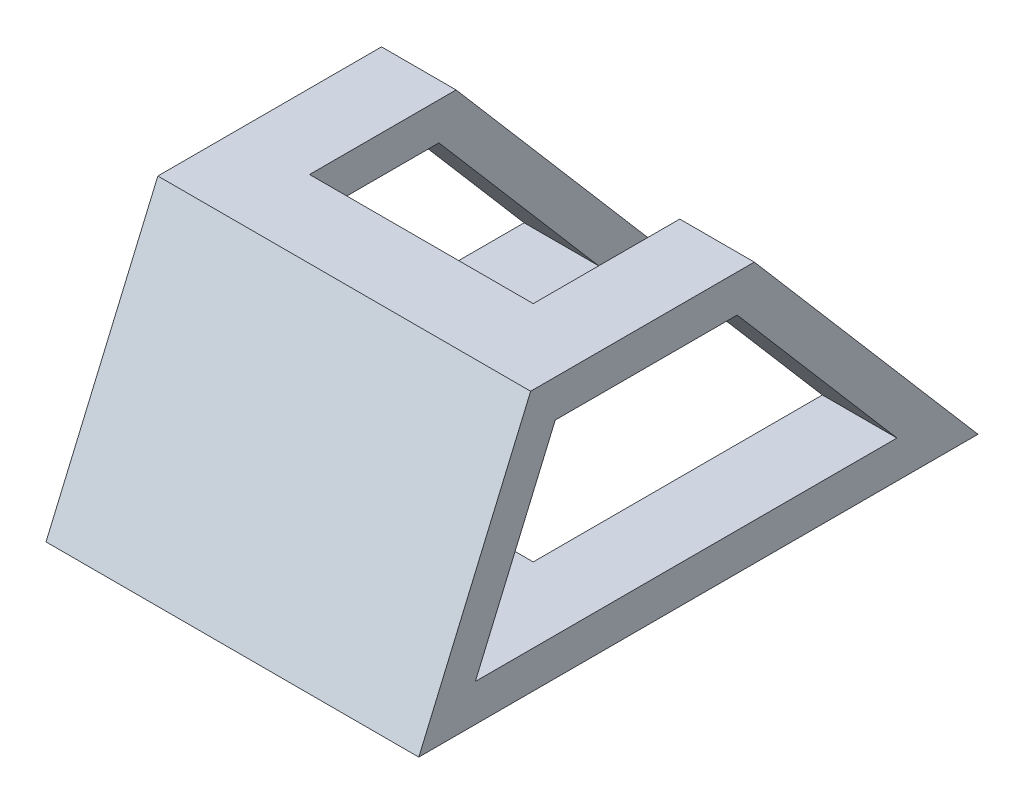
ISO-10303-21;
HEADER;
FILE_DESCRIPTION(('STEP AP214'),'2;1');
FILE_NAME('part.step','',(''),(''),'','','');
FILE_SCHEMA(('AUTOMOTIVE_DESIGN { 1 0 10303 214 1 1 1 1 }'));
ENDSEC;
DATA;
#1=APPLICATION_CONTEXT('core data for automotive mechanical design processes');
#2=APPLICATION_PROTOCOL_DEFINITION('international standard','automotive_design',2000,#1);
#3=PRODUCT_CONTEXT('',#1,'mechanical');
#4=PRODUCT('Part','Part','',(#3));
#5=PRODUCT_RELATED_PRODUCT_CATEGORY('part','',(#4));
#6=PRODUCT_DEFINITION_FORMATION('','',#4);
#7=PRODUCT_DEFINITION_CONTEXT('part definition',#1,'design');
#8=PRODUCT_DEFINITION('design','',#6,#7);
#9=PRODUCT_DEFINITION_SHAPE('','',#8);
#10=(LENGTH_UNIT() NAMED_UNIT(*) SI_UNIT(.MILLI.,.METRE.));
#11=(NAMED_UNIT(*) PLANE_ANGLE_UNIT() SI_UNIT($,.RADIAN.));
#12=(NAMED_UNIT(*) SI_UNIT($,.STERADIAN.) SOLID_ANGLE_UNIT());
#13=UNCERTAINTY_MEASURE_WITH_UNIT(LENGTH_MEASURE(1.E-05),#10,'distance_accuracy_value','');
#14=(GEOMETRIC_REPRESENTATION_CONTEXT(3) GLOBAL_UNCERTAINTY_ASSIGNED_CONTEXT((#13)) GLOBAL_UNIT_ASSIGNED_CONTEXT((#10,
#11,#12)) REPRESENTATION_CONTEXT('',''));
#15=CARTESIAN_POINT('',(0.,0.,0.));
#16=DIRECTION('',(0.,0.,1.));
#17=DIRECTION('',(1.,0.,0.));
#18=AXIS2_PLACEMENT_3D('',#15,#16,#17);
#19=CARTESIAN_POINT('',(100.,70.,-15.));
#20=DIRECTION('',(0.,-0.650791373455969,0.759256602365296));
#21=DIRECTION('',(0.,-0.759256602365296,-0.650791373455969));
#22=AXIS2_PLACEMENT_3D('',#19,#20,#21);
#23=PLANE('',#22);
#24=DIRECTION('',(0.,-0.759256602365296,-0.650791373455969));
#25=VECTOR('',#24,1.);
#26=CARTESIAN_POINT('',(80.,70.,-15.));
#27=LINE('',#26,#25);
#28=CARTESIAN_POINT('',(80.,70.,-15.));
#29=VERTEX_POINT('',#28);
#30=CARTESIAN_POINT('',(80.,0.,-75.));
#31=VERTEX_POINT('',#30);
#32=EDGE_CURVE('E67',#29,#31,#27,.T.);
#33=ORIENTED_EDGE('',*,*,#32,.F.);
#34=DIRECTION('',(-1.,0.,0.));
#35=VECTOR('',#34,1.);
#36=CARTESIAN_POINT('',(100.,70.,-15.));
#37=LINE('',#36,#35);
#38=CARTESIAN_POINT('',(100.,70.,-15.));
#39=VERTEX_POINT('',#38);
#40=EDGE_CURVE('E313',#39,#29,#37,.T.);
#41=ORIENTED_EDGE('',*,*,#40,.F.);
#42=DIRECTION('',(0.,0.759256602365296,0.650791373455969));
#43=VECTOR('',#42,1.);
#44=CARTESIAN_POINT('',(100.,70.,-15.));
#45=LINE('',#44,#43);
#46=CARTESIAN_POINT('',(100.,0.,-75.));
#47=VERTEX_POINT('',#46);
#48=EDGE_CURVE('E274',#47,#39,#45,.T.);
#49=ORIENTED_EDGE('',*,*,#48,.F.);
#50=DIRECTION('',(-1.,0.,0.));
#51=VECTOR('',#50,1.);
#52=CARTESIAN_POINT('',(100.,0.,-75.));
#53=LINE('',#52,#51);
#54=EDGE_CURVE('E301',#47,#31,#53,.T.);
#55=ORIENTED_EDGE('',*,*,#54,.T.);
#56=EDGE_LOOP('',(#33,#41,#49,#55));
#57=FACE_BOUND('',#56,.T.);
#58=ADVANCED_FACE('F51',(#57),#23,.F.);
#59=CARTESIAN_POINT('',(100.,60.,-10.4006507752959));
#60=DIRECTION('',(0.,-0.650791373455969,0.759256602365296));
#61=DIRECTION('',(0.,-0.759256602365296,-0.650791373455969));
#62=AXIS2_PLACEMENT_3D('',#59,#60,#61);
#63=PLANE('',#62);
#64=DIRECTION('',(-1.,0.,0.));
#65=VECTOR('',#64,1.);
#66=CARTESIAN_POINT('',(100.,60.,-10.4006507752959));
#67=LINE('',#66,#65);
#68=CARTESIAN_POINT('',(100.,60.,-10.4006507752959));
#69=VERTEX_POINT('',#68);
#70=CARTESIAN_POINT('',(80.,60.,-10.4006507752959));
#71=VERTEX_POINT('',#70);
#72=EDGE_CURVE('E260',#69,#71,#67,.T.);
#73=ORIENTED_EDGE('',*,*,#72,.T.);
#74=DIRECTION('',(0.,-0.759256602365296,-0.650791373455969));
#75=VECTOR('',#74,1.);
#76=CARTESIAN_POINT('',(80.,60.,-10.4006507752959));
#77=LINE('',#76,#75);
#78=CARTESIAN_POINT('',(80.,10.,-53.2577936324388));
#79=VERTEX_POINT('',#78);
#80=EDGE_CURVE('E74',#71,#79,#77,.T.);
#81=ORIENTED_EDGE('',*,*,#80,.T.);
#82=DIRECTION('',(-1.,0.,0.));
#83=VECTOR('',#82,1.);
#84=CARTESIAN_POINT('',(100.,10.,-53.2577936324388));
#85=LINE('',#84,#83);
#86=CARTESIAN_POINT('',(100.,10.,-53.2577936324388));
#87=VERTEX_POINT('',#86);
#88=EDGE_CURVE('E265',#87,#79,#85,.T.);
#89=ORIENTED_EDGE('',*,*,#88,.F.);
#90=DIRECTION('',(0.,0.759256602365296,0.650791373455969));
#91=VECTOR('',#90,1.);
#92=CARTESIAN_POINT('',(100.,60.,-10.4006507752959));
#93=LINE('',#92,#91);
#94=EDGE_CURVE('E234',#87,#69,#93,.T.);
#95=ORIENTED_EDGE('',*,*,#94,.T.);
#96=EDGE_LOOP('',(#73,#81,#89,#95));
#97=FACE_BOUND('',#96,.T.);
#98=ADVANCED_FACE('F379',(#97),#63,.T.);
#99=CARTESIAN_POINT('',(100.,0.,0.));
#100=DIRECTION('',(1.,0.,0.));
#101=DIRECTION('',(0.,0.,-1.));
#102=AXIS2_PLACEMENT_3D('',#99,#100,#101);
#103=PLANE('',#102);
#104=ORIENTED_EDGE('',*,*,#48,.T.);
#105=DIRECTION('',(0.,0.,1.));
#106=VECTOR('',#105,1.);
#107=CARTESIAN_POINT('',(100.,70.,45.));
#108=LINE('',#107,#106);
#109=CARTESIAN_POINT('',(100.,70.,45.));
#110=VERTEX_POINT('',#109);
#111=EDGE_CURVE('E278',#39,#110,#108,.T.);
#112=ORIENTED_EDGE('',*,*,#111,.T.);
#113=DIRECTION('',(0.,-0.919145030018058,0.393919298579168));
#114=VECTOR('',#113,1.);
#115=CARTESIAN_POINT('',(100.,0.,75.));
#116=LINE('',#115,#114);
#117=CARTESIAN_POINT('',(100.,0.,75.));
#118=VERTEX_POINT('',#117);
#119=EDGE_CURVE('E282',#110,#118,#116,.T.);
#120=ORIENTED_EDGE('',*,*,#119,.T.);
#121=DIRECTION('',(0.,0.,-1.));
#122=VECTOR('',#121,1.);
#123=CARTESIAN_POINT('',(100.,0.,75.));
#124=LINE('',#123,#122);
#125=EDGE_CURVE('E285',#118,#47,#124,.T.);
#126=ORIENTED_EDGE('',*,*,#125,.T.);
#127=EDGE_LOOP('',(#104,#112,#120,#126));
#128=FACE_BOUND('',#127,.T.);
#129=DIRECTION('',(0.,0.,-1.));
#130=VECTOR('',#129,1.);
#131=CARTESIAN_POINT('',(100.,10.,59.8346098487658));
#132=LINE('',#131,#130);
#133=CARTESIAN_POINT('',(100.,10.,59.8346098487658));
#134=VERTEX_POINT('',#133);
#135=EDGE_CURVE('E230',#134,#87,#132,.T.);
#136=ORIENTED_EDGE('',*,*,#135,.F.);
#137=DIRECTION('',(0.,-0.919145030018058,0.393919298579168));
#138=VECTOR('',#137,1.);
#139=CARTESIAN_POINT('',(100.,10.,59.8346098487658));
#140=LINE('',#139,#138);
#141=CARTESIAN_POINT('',(100.,60.,38.4060384201944));
#142=VERTEX_POINT('',#141);
#143=EDGE_CURVE('E227',#142,#134,#140,.T.);
#144=ORIENTED_EDGE('',*,*,#143,.F.);
#145=DIRECTION('',(0.,0.,1.));
#146=VECTOR('',#145,1.);
#147=CARTESIAN_POINT('',(100.,60.,38.4060384201944));
#148=LINE('',#147,#146);
#149=EDGE_CURVE('E238',#69,#142,#148,.T.);
#150=ORIENTED_EDGE('',*,*,#149,.F.);
#151=ORIENTED_EDGE('',*,*,#94,.F.);
#152=EDGE_LOOP('',(#136,#144,#150,#151));
#153=FACE_BOUND('',#152,.T.);
#154=ADVANCED_FACE('F351',(#128,#153),#103,.T.);
#155=CARTESIAN_POINT('',(0.,0.,0.));
#156=DIRECTION('',(1.,0.,0.));
#157=DIRECTION('',(0.,0.,-1.));
#158=AXIS2_PLACEMENT_3D('',#155,#156,#157);
#159=PLANE('',#158);
#160=DIRECTION('',(0.,0.759256602365296,0.650791373455969));
#161=VECTOR('',#160,1.);
#162=CARTESIAN_POINT('',(0.,70.,-15.));
#163=LINE('',#162,#161);
#164=CARTESIAN_POINT('',(0.,0.,-75.));
#165=VERTEX_POINT('',#164);
#166=CARTESIAN_POINT('',(0.,70.,-15.));
#167=VERTEX_POINT('',#166);
#168=EDGE_CURVE('E273',#165,#167,#163,.T.);
#169=ORIENTED_EDGE('',*,*,#168,.F.);
#170=DIRECTION('',(0.,0.,-1.));
#171=VECTOR('',#170,1.);
#172=CARTESIAN_POINT('',(0.,0.,75.));
#173=LINE('',#172,#171);
#174=CARTESIAN_POINT('',(0.,0.,75.));
#175=VERTEX_POINT('',#174);
#176=EDGE_CURVE('E279',#175,#165,#173,.T.);
#177=ORIENTED_EDGE('',*,*,#176,.F.);
#178=DIRECTION('',(0.,-0.919145030018058,0.393919298579168));
#179=VECTOR('',#178,1.);
#180=CARTESIAN_POINT('',(0.,0.,75.));
#181=LINE('',#180,#179);
#182=CARTESIAN_POINT('',(0.,70.,45.));
#183=VERTEX_POINT('',#182);
#184=EDGE_CURVE('E295',#183,#175,#181,.T.);
#185=ORIENTED_EDGE('',*,*,#184,.F.);
#186=DIRECTION('',(0.,0.,1.));
#187=VECTOR('',#186,1.);
#188=CARTESIAN_POINT('',(0.,70.,45.));
#189=LINE('',#188,#187);
#190=EDGE_CURVE('E292',#167,#183,#189,.T.);
#191=ORIENTED_EDGE('',*,*,#190,.F.);
#192=EDGE_LOOP('',(#169,#177,#185,#191));
#193=FACE_BOUND('',#192,.T.);
#194=DIRECTION('',(0.,-0.919145030018058,0.393919298579168));
#195=VECTOR('',#194,1.);
#196=CARTESIAN_POINT('',(0.,10.,59.8346098487658));
#197=LINE('',#196,#195);
#198=CARTESIAN_POINT('',(0.,60.,38.4060384201944));
#199=VERTEX_POINT('',#198);
#200=CARTESIAN_POINT('',(0.,10.,59.8346098487658));
#201=VERTEX_POINT('',#200);
#202=EDGE_CURVE('E226',#199,#201,#197,.T.);
#203=ORIENTED_EDGE('',*,*,#202,.T.);
#204=DIRECTION('',(0.,0.,-1.));
#205=VECTOR('',#204,1.);
#206=CARTESIAN_POINT('',(0.,10.,59.8346098487658));
#207=LINE('',#206,#205);
#208=CARTESIAN_POINT('',(0.,10.,-53.2577936324388));
#209=VERTEX_POINT('',#208);
#210=EDGE_CURVE('E245',#201,#209,#207,.T.);
#211=ORIENTED_EDGE('',*,*,#210,.T.);
#212=DIRECTION('',(0.,0.759256602365296,0.650791373455969));
#213=VECTOR('',#212,1.);
#214=CARTESIAN_POINT('',(0.,60.,-10.4006507752959));
#215=LINE('',#214,#213);
#216=CARTESIAN_POINT('',(0.,60.,-10.4006507752959));
#217=VERTEX_POINT('',#216);
#218=EDGE_CURVE('E249',#209,#217,#215,.T.);
#219=ORIENTED_EDGE('',*,*,#218,.T.);
#220=DIRECTION('',(0.,0.,1.));
#221=VECTOR('',#220,1.);
#222=CARTESIAN_POINT('',(0.,60.,38.4060384201944));
#223=LINE('',#222,#221);
#224=EDGE_CURVE('E231',#217,#199,#223,.T.);
#225=ORIENTED_EDGE('',*,*,#224,.T.);
#226=EDGE_LOOP('',(#203,#211,#219,#225));
#227=FACE_BOUND('',#226,.T.);
#228=ADVANCED_FACE('F360',(#193,#227),#159,.F.);
#229=CARTESIAN_POINT('',(20.,70.,-15.));
#230=VERTEX_POINT('',#229);
#231=EDGE_CURVE('E312',#230,#167,#37,.T.);
#232=ORIENTED_EDGE('',*,*,#231,.F.);
#233=DIRECTION('',(0.,-0.759256602365296,-0.650791373455969));
#234=VECTOR('',#233,1.);
#235=CARTESIAN_POINT('',(20.,70.,-15.));
#236=LINE('',#235,#234);
#237=CARTESIAN_POINT('',(20.,0.,-75.));
#238=VERTEX_POINT('',#237);
#239=EDGE_CURVE('E220',#230,#238,#236,.T.);
#240=ORIENTED_EDGE('',*,*,#239,.T.);
#241=EDGE_CURVE('E288',#238,#165,#53,.T.);
#242=ORIENTED_EDGE('',*,*,#241,.T.);
#243=ORIENTED_EDGE('',*,*,#168,.T.);
#244=EDGE_LOOP('',(#232,#240,#242,#243));
#245=FACE_BOUND('',#244,.T.);
#246=ADVANCED_FACE('F53',(#245),#23,.F.);
#247=CARTESIAN_POINT('',(100.,70.,45.));
#248=DIRECTION('',(0.,-1.,0.));
#249=DIRECTION('',(0.,0.,-1.));
#250=AXIS2_PLACEMENT_3D('',#247,#248,#249);
#251=PLANE('',#250);
#252=DIRECTION('',(1.,0.,0.));
#253=VECTOR('',#252,1.);
#254=CARTESIAN_POINT('',(20.,70.,24.3027668576911));
#255=LINE('',#254,#253);
#256=CARTESIAN_POINT('',(20.,70.,24.3027668576911));
#257=VERTEX_POINT('',#256);
#258=CARTESIAN_POINT('',(80.,70.,24.3027668576911));
#259=VERTEX_POINT('',#258);
#260=EDGE_CURVE('E197',#257,#259,#255,.T.);
#261=ORIENTED_EDGE('',*,*,#260,.F.);
#262=DIRECTION('',(0.,0.,1.));
#263=VECTOR('',#262,1.);
#264=CARTESIAN_POINT('',(20.,70.,-75.6972331423089));
#265=LINE('',#264,#263);
#266=EDGE_CURVE('E188',#230,#257,#265,.T.);
#267=ORIENTED_EDGE('',*,*,#266,.F.);
#268=ORIENTED_EDGE('',*,*,#231,.T.);
#269=ORIENTED_EDGE('',*,*,#190,.T.);
#270=DIRECTION('',(-1.,0.,0.));
#271=VECTOR('',#270,1.);
#272=CARTESIAN_POINT('',(100.,70.,45.));
#273=LINE('',#272,#271);
#274=EDGE_CURVE('E308',#110,#183,#273,.T.);
#275=ORIENTED_EDGE('',*,*,#274,.F.);
#276=ORIENTED_EDGE('',*,*,#111,.F.);
#277=ORIENTED_EDGE('',*,*,#40,.T.);
#278=DIRECTION('',(0.,0.,1.));
#279=VECTOR('',#278,1.);
#280=CARTESIAN_POINT('',(80.,70.,-75.6972331423089));
#281=LINE('',#280,#279);
#282=EDGE_CURVE('E192',#29,#259,#281,.T.);
#283=ORIENTED_EDGE('',*,*,#282,.T.);
#284=EDGE_LOOP('',(#261,#267,#268,#269,#275,#276,#277,#283));
#285=FACE_BOUND('',#284,.T.);
#286=ADVANCED_FACE('F342',(#285),#251,.F.);
#287=CARTESIAN_POINT('',(100.,0.,75.));
#288=DIRECTION('',(0.,-0.393919298579168,-0.919145030018058));
#289=DIRECTION('',(0.,0.919145030018058,-0.393919298579168));
#290=AXIS2_PLACEMENT_3D('',#287,#288,#289);
#291=PLANE('',#290);
#292=ORIENTED_EDGE('',*,*,#184,.T.);
#293=DIRECTION('',(-1.,0.,0.));
#294=VECTOR('',#293,1.);
#295=CARTESIAN_POINT('',(100.,0.,75.));
#296=LINE('',#295,#294);
#297=EDGE_CURVE('E304',#118,#175,#296,.T.);
#298=ORIENTED_EDGE('',*,*,#297,.F.);
#299=ORIENTED_EDGE('',*,*,#119,.F.);
#300=ORIENTED_EDGE('',*,*,#274,.T.);
#301=EDGE_LOOP('',(#292,#298,#299,#300));
#302=FACE_BOUND('',#301,.T.);
#303=ADVANCED_FACE('F355',(#302),#291,.F.);
#304=CARTESIAN_POINT('',(100.,0.,75.));
#305=DIRECTION('',(0.,1.,0.));
#306=DIRECTION('',(0.,0.,1.));
#307=AXIS2_PLACEMENT_3D('',#304,#305,#306);
#308=PLANE('',#307);
#309=ORIENTED_EDGE('',*,*,#241,.F.);
#310=DIRECTION('',(0.,0.,1.));
#311=VECTOR('',#310,1.);
#312=CARTESIAN_POINT('',(20.,0.,-75.6972331423089));
#313=LINE('',#312,#311);
#314=CARTESIAN_POINT('',(20.,0.,24.3027668576911));
#315=VERTEX_POINT('',#314);
#316=EDGE_CURVE('E171',#238,#315,#313,.T.);
#317=ORIENTED_EDGE('',*,*,#316,.T.);
#318=DIRECTION('',(1.,0.,0.));
#319=VECTOR('',#318,1.);
#320=CARTESIAN_POINT('',(20.,0.,24.3027668576911));
#321=LINE('',#320,#319);
#322=CARTESIAN_POINT('',(80.,0.,24.3027668576911));
#323=VERTEX_POINT('',#322);
#324=EDGE_CURVE('E172',#315,#323,#321,.T.);
#325=ORIENTED_EDGE('',*,*,#324,.T.);
#326=DIRECTION('',(0.,0.,1.));
#327=VECTOR('',#326,1.);
#328=CARTESIAN_POINT('',(80.,0.,-75.6972331423089));
#329=LINE('',#328,#327);
#330=EDGE_CURVE('E161',#31,#323,#329,.T.);
#331=ORIENTED_EDGE('',*,*,#330,.F.);
#332=ORIENTED_EDGE('',*,*,#54,.F.);
#333=ORIENTED_EDGE('',*,*,#125,.F.);
#334=ORIENTED_EDGE('',*,*,#297,.T.);
#335=ORIENTED_EDGE('',*,*,#176,.T.);
#336=EDGE_LOOP('',(#309,#317,#325,#331,#332,#333,#334,#335));
#337=FACE_BOUND('',#336,.T.);
#338=ADVANCED_FACE('F186',(#337),#308,.F.);
#339=CARTESIAN_POINT('',(100.,10.,59.8346098487658));
#340=DIRECTION('',(0.,-0.393919298579168,-0.919145030018058));
#341=DIRECTION('',(0.,0.919145030018058,-0.393919298579168));
#342=AXIS2_PLACEMENT_3D('',#339,#340,#341);
#343=PLANE('',#342);
#344=ORIENTED_EDGE('',*,*,#202,.F.);
#345=DIRECTION('',(-1.,0.,0.));
#346=VECTOR('',#345,1.);
#347=CARTESIAN_POINT('',(100.,60.,38.4060384201944));
#348=LINE('',#347,#346);
#349=EDGE_CURVE('E241',#142,#199,#348,.T.);
#350=ORIENTED_EDGE('',*,*,#349,.F.);
#351=ORIENTED_EDGE('',*,*,#143,.T.);
#352=DIRECTION('',(-1.,0.,0.));
#353=VECTOR('',#352,1.);
#354=CARTESIAN_POINT('',(100.,10.,59.8346098487658));
#355=LINE('',#354,#353);
#356=EDGE_CURVE('E269',#134,#201,#355,.T.);
#357=ORIENTED_EDGE('',*,*,#356,.T.);
#358=EDGE_LOOP('',(#344,#350,#351,#357));
#359=FACE_BOUND('',#358,.T.);
#360=ADVANCED_FACE('F372',(#359),#343,.T.);
#361=CARTESIAN_POINT('',(100.,10.,59.8346098487658));
#362=DIRECTION('',(0.,1.,0.));
#363=DIRECTION('',(0.,0.,1.));
#364=AXIS2_PLACEMENT_3D('',#361,#362,#363);
#365=PLANE('',#364);
#366=DIRECTION('',(0.,0.,1.));
#367=VECTOR('',#366,1.);
#368=CARTESIAN_POINT('',(20.,10.,59.8346098487659));
#369=LINE('',#368,#367);
#370=CARTESIAN_POINT('',(20.,9.99999999999999,-53.2577936324388));
#371=VERTEX_POINT('',#370);
#372=CARTESIAN_POINT('',(20.,10.,24.3027668576911));
#373=VERTEX_POINT('',#372);
#374=EDGE_CURVE('E217',#371,#373,#369,.T.);
#375=ORIENTED_EDGE('',*,*,#374,.F.);
#376=EDGE_CURVE('E264',#371,#209,#85,.T.);
#377=ORIENTED_EDGE('',*,*,#376,.T.);
#378=ORIENTED_EDGE('',*,*,#210,.F.);
#379=ORIENTED_EDGE('',*,*,#356,.F.);
#380=ORIENTED_EDGE('',*,*,#135,.T.);
#381=ORIENTED_EDGE('',*,*,#88,.T.);
#382=DIRECTION('',(0.,0.,1.));
#383=VECTOR('',#382,1.);
#384=CARTESIAN_POINT('',(80.,10.,59.8346098487659));
#385=LINE('',#384,#383);
#386=CARTESIAN_POINT('',(80.,10.,24.3027668576911));
#387=VERTEX_POINT('',#386);
#388=EDGE_CURVE('E209',#79,#387,#385,.T.);
#389=ORIENTED_EDGE('',*,*,#388,.T.);
#390=DIRECTION('',(1.,0.,0.));
#391=VECTOR('',#390,1.);
#392=CARTESIAN_POINT('',(100.,10.,24.3027668576911));
#393=LINE('',#392,#391);
#394=EDGE_CURVE('E180',#373,#387,#393,.T.);
#395=ORIENTED_EDGE('',*,*,#394,.F.);
#396=EDGE_LOOP('',(#375,#377,#378,#379,#380,#381,#389,#395));
#397=FACE_BOUND('',#396,.T.);
#398=ADVANCED_FACE('F367',(#397),#365,.T.);
#399=DIRECTION('',(0.,-0.759256602365296,-0.650791373455969));
#400=VECTOR('',#399,1.);
#401=CARTESIAN_POINT('',(20.,60.,-10.4006507752959));
#402=LINE('',#401,#400);
#403=CARTESIAN_POINT('',(20.,60.,-10.4006507752959));
#404=VERTEX_POINT('',#403);
#405=EDGE_CURVE('E214',#404,#371,#402,.T.);
#406=ORIENTED_EDGE('',*,*,#405,.F.);
#407=EDGE_CURVE('E259',#404,#217,#67,.T.);
#408=ORIENTED_EDGE('',*,*,#407,.T.);
#409=ORIENTED_EDGE('',*,*,#218,.F.);
#410=ORIENTED_EDGE('',*,*,#376,.F.);
#411=EDGE_LOOP('',(#406,#408,#409,#410));
#412=FACE_BOUND('',#411,.T.);
#413=ADVANCED_FACE('F369',(#412),#63,.T.);
#414=CARTESIAN_POINT('',(100.,60.,38.4060384201944));
#415=DIRECTION('',(0.,-1.,0.));
#416=DIRECTION('',(0.,0.,-1.));
#417=AXIS2_PLACEMENT_3D('',#414,#415,#416);
#418=PLANE('',#417);
#419=DIRECTION('',(0.,0.,-1.));
#420=VECTOR('',#419,1.);
#421=CARTESIAN_POINT('',(20.,60.,38.4060384201944));
#422=LINE('',#421,#420);
#423=CARTESIAN_POINT('',(20.,60.,24.3027668576911));
#424=VERTEX_POINT('',#423);
#425=EDGE_CURVE('E11',#424,#404,#422,.T.);
#426=ORIENTED_EDGE('',*,*,#425,.F.);
#427=DIRECTION('',(-1.,0.,0.));
#428=VECTOR('',#427,1.);
#429=CARTESIAN_POINT('',(100.,60.,24.3027668576911));
#430=LINE('',#429,#428);
#431=CARTESIAN_POINT('',(80.,60.,24.3027668576911));
#432=VERTEX_POINT('',#431);
#433=EDGE_CURVE('E60',#432,#424,#430,.T.);
#434=ORIENTED_EDGE('',*,*,#433,.F.);
#435=DIRECTION('',(0.,0.,-1.));
#436=VECTOR('',#435,1.);
#437=CARTESIAN_POINT('',(80.,60.,38.4060384201944));
#438=LINE('',#437,#436);
#439=EDGE_CURVE('E317',#432,#71,#438,.T.);
#440=ORIENTED_EDGE('',*,*,#439,.T.);
#441=ORIENTED_EDGE('',*,*,#72,.F.);
#442=ORIENTED_EDGE('',*,*,#149,.T.);
#443=ORIENTED_EDGE('',*,*,#349,.T.);
#444=ORIENTED_EDGE('',*,*,#224,.F.);
#445=ORIENTED_EDGE('',*,*,#407,.F.);
#446=EDGE_LOOP('',(#426,#434,#440,#441,#442,#443,#444,#445));
#447=FACE_BOUND('',#446,.T.);
#448=ADVANCED_FACE('F334',(#447),#418,.T.);
#449=CARTESIAN_POINT('',(20.,0.,24.3027668576911));
#450=DIRECTION('',(0.,0.,1.));
#451=DIRECTION('',(1.,0.,0.));
#452=AXIS2_PLACEMENT_3D('',#449,#450,#451);
#453=PLANE('',#452);
#454=ORIENTED_EDGE('',*,*,#394,.T.);
#455=DIRECTION('',(0.,1.,0.));
#456=VECTOR('',#455,1.);
#457=CARTESIAN_POINT('',(80.,0.,24.3027668576911));
#458=LINE('',#457,#456);
#459=EDGE_CURVE('E164',#323,#387,#458,.T.);
#460=ORIENTED_EDGE('',*,*,#459,.F.);
#461=ORIENTED_EDGE('',*,*,#324,.F.);
#462=DIRECTION('',(0.,1.,0.));
#463=VECTOR('',#462,1.);
#464=CARTESIAN_POINT('',(20.,0.,24.3027668576911));
#465=LINE('',#464,#463);
#466=EDGE_CURVE('E204',#315,#373,#465,.T.);
#467=ORIENTED_EDGE('',*,*,#466,.T.);
#468=EDGE_LOOP('',(#454,#460,#461,#467));
#469=FACE_BOUND('',#468,.T.);
#470=ADVANCED_FACE('F176',(#469),#453,.F.);
#471=CARTESIAN_POINT('',(20.,0.,-75.6972331423089));
#472=DIRECTION('',(-1.,0.,0.));
#473=DIRECTION('',(0.,0.,1.));
#474=AXIS2_PLACEMENT_3D('',#471,#472,#473);
#475=PLANE('',#474);
#476=ORIENTED_EDGE('',*,*,#266,.T.);
#477=EDGE_CURVE('E182',#424,#257,#465,.T.);
#478=ORIENTED_EDGE('',*,*,#477,.F.);
#479=ORIENTED_EDGE('',*,*,#425,.T.);
#480=ORIENTED_EDGE('',*,*,#405,.T.);
#481=ORIENTED_EDGE('',*,*,#374,.T.);
#482=ORIENTED_EDGE('',*,*,#466,.F.);
#483=ORIENTED_EDGE('',*,*,#316,.F.);
#484=ORIENTED_EDGE('',*,*,#239,.F.);
#485=EDGE_LOOP('',(#476,#478,#479,#480,#481,#482,#483,#484));
#486=FACE_BOUND('',#485,.T.);
#487=ADVANCED_FACE('F328',(#486),#475,.F.);
#488=CARTESIAN_POINT('',(80.,0.,-75.6972331423089));
#489=DIRECTION('',(-1.,0.,0.));
#490=DIRECTION('',(0.,0.,1.));
#491=AXIS2_PLACEMENT_3D('',#488,#489,#490);
#492=PLANE('',#491);
#493=ORIENTED_EDGE('',*,*,#32,.T.);
#494=ORIENTED_EDGE('',*,*,#330,.T.);
#495=ORIENTED_EDGE('',*,*,#459,.T.);
#496=ORIENTED_EDGE('',*,*,#388,.F.);
#497=ORIENTED_EDGE('',*,*,#80,.F.);
#498=ORIENTED_EDGE('',*,*,#439,.F.);
#499=EDGE_CURVE('E183',#432,#259,#458,.T.);
#500=ORIENTED_EDGE('',*,*,#499,.T.);
#501=ORIENTED_EDGE('',*,*,#282,.F.);
#502=EDGE_LOOP('',(#493,#494,#495,#496,#497,#498,#500,#501));
#503=FACE_BOUND('',#502,.T.);
#504=ADVANCED_FACE('F163',(#503),#492,.T.);
#505=ORIENTED_EDGE('',*,*,#433,.T.);
#506=ORIENTED_EDGE('',*,*,#477,.T.);
#507=ORIENTED_EDGE('',*,*,#260,.T.);
#508=ORIENTED_EDGE('',*,*,#499,.F.);
#509=EDGE_LOOP('',(#505,#506,#507,#508));
#510=FACE_BOUND('',#509,.T.);
#511=ADVANCED_FACE('F324',(#510),#453,.F.);
#512=CLOSED_SHELL('',(#58,#98,#154,#228,#246,#286,#303,#338,#360,#398,#413,#448,#470,#487,#504,#511));
#513=MANIFOLD_SOLID_BREP('B2',#512);
#514=ADVANCED_BREP_SHAPE_REPRESENTATION('',(#18,#513),#14);
#515=SHAPE_DEFINITION_REPRESENTATION(#9,#514);
ENDSEC;
END-ISO-10303-21;
